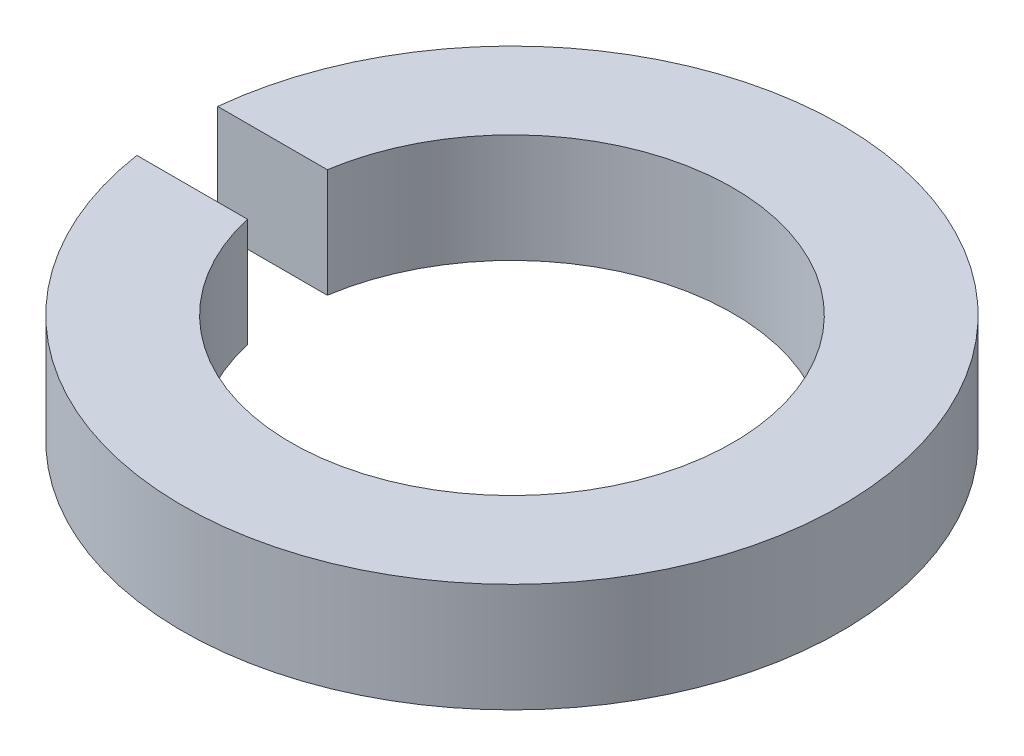
ISO-10303-21;
HEADER;
FILE_DESCRIPTION(('STEP AP214'),'2;1');
FILE_NAME('part.step','',(''),(''),'','','');
FILE_SCHEMA(('AUTOMOTIVE_DESIGN { 1 0 10303 214 1 1 1 1 }'));
ENDSEC;
DATA;
#1=APPLICATION_CONTEXT('core data for automotive mechanical design processes');
#2=APPLICATION_PROTOCOL_DEFINITION('international standard','automotive_design',2000,#1);
#3=PRODUCT_CONTEXT('',#1,'mechanical');
#4=PRODUCT('Part','Part','',(#3));
#5=PRODUCT_RELATED_PRODUCT_CATEGORY('part','',(#4));
#6=PRODUCT_DEFINITION_FORMATION('','',#4);
#7=PRODUCT_DEFINITION_CONTEXT('part definition',#1,'design');
#8=PRODUCT_DEFINITION('design','',#6,#7);
#9=PRODUCT_DEFINITION_SHAPE('','',#8);
#10=(LENGTH_UNIT() NAMED_UNIT(*) SI_UNIT(.MILLI.,.METRE.));
#11=(NAMED_UNIT(*) PLANE_ANGLE_UNIT() SI_UNIT($,.RADIAN.));
#12=(NAMED_UNIT(*) SI_UNIT($,.STERADIAN.) SOLID_ANGLE_UNIT());
#13=UNCERTAINTY_MEASURE_WITH_UNIT(LENGTH_MEASURE(1.E-05),#10,'distance_accuracy_value','');
#14=(GEOMETRIC_REPRESENTATION_CONTEXT(3) GLOBAL_UNCERTAINTY_ASSIGNED_CONTEXT((#13)) GLOBAL_UNIT_ASSIGNED_CONTEXT((#10,
#11,#12)) REPRESENTATION_CONTEXT('',''));
#15=CARTESIAN_POINT('',(0.,0.,0.));
#16=DIRECTION('',(0.,0.,1.));
#17=DIRECTION('',(1.,0.,0.));
#18=AXIS2_PLACEMENT_3D('',#15,#16,#17);
#19=CARTESIAN_POINT('',(0.,0.8,0.));
#20=DIRECTION('',(0.,-1.,0.));
#21=DIRECTION('',(0.,0.,-1.));
#22=AXIS2_PLACEMENT_3D('',#19,#20,#21);
#23=CYLINDRICAL_SURFACE('',#22,1.625);
#24=CARTESIAN_POINT('',(0.,0.,0.));
#25=DIRECTION('',(0.,-1.,0.));
#26=DIRECTION('',(0.,0.,1.));
#27=AXIS2_PLACEMENT_3D('',#24,#25,#26);
#28=CIRCLE('',#27,1.625);
#29=CARTESIAN_POINT('',(-1.60599478567151,0.,-0.247801832914784));
#30=VERTEX_POINT('',#29);
#31=CARTESIAN_POINT('',(-1.5843191513539,0.,0.36132786586874));
#32=VERTEX_POINT('',#31);
#33=EDGE_CURVE('E98',#30,#32,#28,.T.);
#34=ORIENTED_EDGE('',*,*,#33,.T.);
#35=DIRECTION('',(0.,-1.,0.));
#36=VECTOR('',#35,1.);
#37=CARTESIAN_POINT('',(-1.5843191513539,0.8,0.36132786586874));
#38=LINE('',#37,#36);
#39=CARTESIAN_POINT('',(-1.5843191513539,0.8,0.36132786586874));
#40=VERTEX_POINT('',#39);
#41=EDGE_CURVE('E11',#40,#32,#38,.T.);
#42=ORIENTED_EDGE('',*,*,#41,.F.);
#43=CARTESIAN_POINT('',(0.,0.8,0.));
#44=DIRECTION('',(0.,-1.,0.));
#45=DIRECTION('',(0.,0.,1.));
#46=AXIS2_PLACEMENT_3D('',#43,#44,#45);
#47=CIRCLE('',#46,1.625);
#48=CARTESIAN_POINT('',(-1.60599478567151,0.8,-0.247801832914784));
#49=VERTEX_POINT('',#48);
#50=EDGE_CURVE('E86',#49,#40,#47,.T.);
#51=ORIENTED_EDGE('',*,*,#50,.F.);
#52=DIRECTION('',(0.,-1.,0.));
#53=VECTOR('',#52,1.);
#54=CARTESIAN_POINT('',(-1.60599478567151,0.8,-0.247801832914784));
#55=LINE('',#54,#53);
#56=EDGE_CURVE('E94',#49,#30,#55,.T.);
#57=ORIENTED_EDGE('',*,*,#56,.T.);
#58=EDGE_LOOP('',(#34,#42,#51,#57));
#59=FACE_BOUND('',#58,.T.);
#60=ADVANCED_FACE('F35',(#59),#23,.F.);
#61=CARTESIAN_POINT('',(-2.39792976822649,0.8,0.36132786586874));
#62=DIRECTION('',(0.,0.,1.));
#63=DIRECTION('',(1.,0.,0.));
#64=AXIS2_PLACEMENT_3D('',#61,#62,#63);
#65=PLANE('',#64);
#66=DIRECTION('',(-1.,0.,0.));
#67=VECTOR('',#66,1.);
#68=CARTESIAN_POINT('',(-2.39792976822649,0.,0.36132786586874));
#69=LINE('',#68,#67);
#70=CARTESIAN_POINT('',(-2.39792976822649,0.,0.36132786586874));
#71=VERTEX_POINT('',#70);
#72=EDGE_CURVE('E90',#32,#71,#69,.T.);
#73=ORIENTED_EDGE('',*,*,#72,.T.);
#74=DIRECTION('',(0.,-1.,0.));
#75=VECTOR('',#74,1.);
#76=CARTESIAN_POINT('',(-2.39792976822649,0.8,0.36132786586874));
#77=LINE('',#76,#75);
#78=CARTESIAN_POINT('',(-2.39792976822649,0.8,0.36132786586874));
#79=VERTEX_POINT('',#78);
#80=EDGE_CURVE('E43',#79,#71,#77,.T.);
#81=ORIENTED_EDGE('',*,*,#80,.F.);
#82=DIRECTION('',(-1.,0.,0.));
#83=VECTOR('',#82,1.);
#84=CARTESIAN_POINT('',(-2.39792976822649,0.8,0.36132786586874));
#85=LINE('',#84,#83);
#86=EDGE_CURVE('E81',#40,#79,#85,.T.);
#87=ORIENTED_EDGE('',*,*,#86,.F.);
#88=ORIENTED_EDGE('',*,*,#41,.T.);
#89=EDGE_LOOP('',(#73,#81,#87,#88));
#90=FACE_BOUND('',#89,.T.);
#91=ADVANCED_FACE('F89',(#90),#65,.F.);
#92=CARTESIAN_POINT('',(0.,0.8,0.));
#93=DIRECTION('',(0.,-1.,0.));
#94=DIRECTION('',(0.,0.,-1.));
#95=AXIS2_PLACEMENT_3D('',#92,#93,#94);
#96=CYLINDRICAL_SURFACE('',#95,2.425);
#97=CARTESIAN_POINT('',(0.,0.,0.));
#98=DIRECTION('',(0.,1.,0.));
#99=DIRECTION('',(0.,0.,1.));
#100=AXIS2_PLACEMENT_3D('',#97,#98,#99);
#101=CIRCLE('',#100,2.425);
#102=CARTESIAN_POINT('',(-2.41230579562461,0.,-0.247801832914784));
#103=VERTEX_POINT('',#102);
#104=EDGE_CURVE('E68',#71,#103,#101,.T.);
#105=ORIENTED_EDGE('',*,*,#104,.T.);
#106=DIRECTION('',(0.,-1.,0.));
#107=VECTOR('',#106,1.);
#108=CARTESIAN_POINT('',(-2.41230579562461,0.8,-0.247801832914784));
#109=LINE('',#108,#107);
#110=CARTESIAN_POINT('',(-2.41230579562461,0.8,-0.247801832914784));
#111=VERTEX_POINT('',#110);
#112=EDGE_CURVE('E91',#111,#103,#109,.T.);
#113=ORIENTED_EDGE('',*,*,#112,.F.);
#114=CARTESIAN_POINT('',(0.,0.8,0.));
#115=DIRECTION('',(0.,1.,0.));
#116=DIRECTION('',(0.,0.,1.));
#117=AXIS2_PLACEMENT_3D('',#114,#115,#116);
#118=CIRCLE('',#117,2.425);
#119=EDGE_CURVE('E84',#79,#111,#118,.T.);
#120=ORIENTED_EDGE('',*,*,#119,.F.);
#121=ORIENTED_EDGE('',*,*,#80,.T.);
#122=EDGE_LOOP('',(#105,#113,#120,#121));
#123=FACE_BOUND('',#122,.T.);
#124=ADVANCED_FACE('F92',(#123),#96,.T.);
#125=CARTESIAN_POINT('',(-1.60599478567151,0.8,-0.247801832914784));
#126=DIRECTION('',(0.,0.,-1.));
#127=DIRECTION('',(-1.,0.,0.));
#128=AXIS2_PLACEMENT_3D('',#125,#126,#127);
#129=PLANE('',#128);
#130=DIRECTION('',(1.,0.,0.));
#131=VECTOR('',#130,1.);
#132=CARTESIAN_POINT('',(-1.60599478567151,0.,-0.247801832914784));
#133=LINE('',#132,#131);
#134=EDGE_CURVE('E74',#103,#30,#133,.T.);
#135=ORIENTED_EDGE('',*,*,#134,.T.);
#136=ORIENTED_EDGE('',*,*,#56,.F.);
#137=DIRECTION('',(1.,0.,0.));
#138=VECTOR('',#137,1.);
#139=CARTESIAN_POINT('',(-1.60599478567151,0.8,-0.247801832914784));
#140=LINE('',#139,#138);
#141=EDGE_CURVE('E51',#111,#49,#140,.T.);
#142=ORIENTED_EDGE('',*,*,#141,.F.);
#143=ORIENTED_EDGE('',*,*,#112,.T.);
#144=EDGE_LOOP('',(#135,#136,#142,#143));
#145=FACE_BOUND('',#144,.T.);
#146=ADVANCED_FACE('F105',(#145),#129,.F.);
#147=CARTESIAN_POINT('',(0.,0.8,0.));
#148=DIRECTION('',(0.,1.,0.));
#149=DIRECTION('',(0.,0.,1.));
#150=AXIS2_PLACEMENT_3D('',#147,#148,#149);
#151=PLANE('',#150);
#152=ORIENTED_EDGE('',*,*,#50,.T.);
#153=ORIENTED_EDGE('',*,*,#86,.T.);
#154=ORIENTED_EDGE('',*,*,#119,.T.);
#155=ORIENTED_EDGE('',*,*,#141,.T.);
#156=EDGE_LOOP('',(#152,#153,#154,#155));
#157=FACE_BOUND('',#156,.T.);
#158=ADVANCED_FACE('F82',(#157),#151,.T.);
#159=CARTESIAN_POINT('',(0.,0.,0.));
#160=DIRECTION('',(0.,1.,0.));
#161=DIRECTION('',(0.,0.,1.));
#162=AXIS2_PLACEMENT_3D('',#159,#160,#161);
#163=PLANE('',#162);
#164=ORIENTED_EDGE('',*,*,#33,.F.);
#165=ORIENTED_EDGE('',*,*,#134,.F.);
#166=ORIENTED_EDGE('',*,*,#104,.F.);
#167=ORIENTED_EDGE('',*,*,#72,.F.);
#168=EDGE_LOOP('',(#164,#165,#166,#167));
#169=FACE_BOUND('',#168,.T.);
#170=ADVANCED_FACE('F108',(#169),#163,.F.);
#171=CLOSED_SHELL('',(#60,#91,#124,#146,#158,#170));
#172=MANIFOLD_SOLID_BREP('B2',#171);
#173=ADVANCED_BREP_SHAPE_REPRESENTATION('',(#18,#172),#14);
#174=SHAPE_DEFINITION_REPRESENTATION(#9,#173);
ENDSEC;
END-ISO-10303-21;
